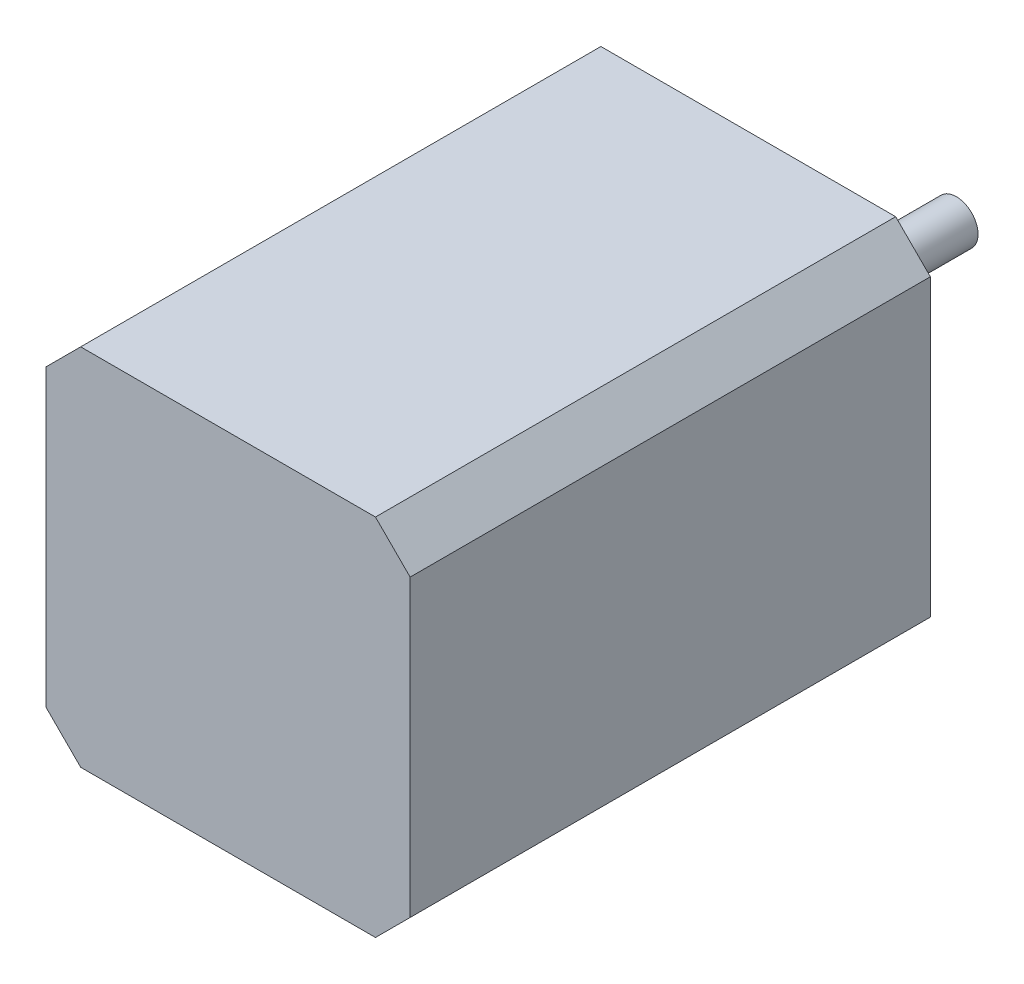
ISO-10303-21;
HEADER;
FILE_DESCRIPTION(('STEP AP214'),'2;1');
FILE_NAME('part.step','',(''),(''),'','','');
FILE_SCHEMA(('AUTOMOTIVE_DESIGN { 1 0 10303 214 1 1 1 1 }'));
ENDSEC;
DATA;
#1=APPLICATION_CONTEXT('core data for automotive mechanical design processes');
#2=APPLICATION_PROTOCOL_DEFINITION('international standard','automotive_design',2000,#1);
#3=PRODUCT_CONTEXT('',#1,'mechanical');
#4=PRODUCT('Part','Part','',(#3));
#5=PRODUCT_RELATED_PRODUCT_CATEGORY('part','',(#4));
#6=PRODUCT_DEFINITION_FORMATION('','',#4);
#7=PRODUCT_DEFINITION_CONTEXT('part definition',#1,'design');
#8=PRODUCT_DEFINITION('design','',#6,#7);
#9=PRODUCT_DEFINITION_SHAPE('','',#8);
#10=(LENGTH_UNIT() NAMED_UNIT(*) SI_UNIT(.MILLI.,.METRE.));
#11=(NAMED_UNIT(*) PLANE_ANGLE_UNIT() SI_UNIT($,.RADIAN.));
#12=(NAMED_UNIT(*) SI_UNIT($,.STERADIAN.) SOLID_ANGLE_UNIT());
#13=UNCERTAINTY_MEASURE_WITH_UNIT(LENGTH_MEASURE(1.E-05),#10,'distance_accuracy_value','');
#14=(GEOMETRIC_REPRESENTATION_CONTEXT(3) GLOBAL_UNCERTAINTY_ASSIGNED_CONTEXT((#13)) GLOBAL_UNIT_ASSIGNED_CONTEXT((#10,
#11,#12)) REPRESENTATION_CONTEXT('',''));
#15=CARTESIAN_POINT('',(0.,0.,0.));
#16=DIRECTION('',(0.,0.,1.));
#17=DIRECTION('',(1.,0.,0.));
#18=AXIS2_PLACEMENT_3D('',#15,#16,#17);
#19=CARTESIAN_POINT('',(0.,0.,0.));
#20=DIRECTION('',(0.,0.,-1.));
#21=DIRECTION('',(-1.,0.,0.));
#22=AXIS2_PLACEMENT_3D('',#19,#20,#21);
#23=PLANE('',#22);
#24=CARTESIAN_POINT('',(-15.5,-15.5,0.));
#25=DIRECTION('',(0.,0.,-1.));
#26=DIRECTION('',(-1.,0.,0.));
#27=AXIS2_PLACEMENT_3D('',#24,#25,#26);
#28=CIRCLE('',#27,1.24999999999999);
#29=CARTESIAN_POINT('',(-16.75,-15.5,0.));
#30=VERTEX_POINT('',#29);
#31=EDGE_CURVE('E161',#30,#30,#28,.T.);
#32=ORIENTED_EDGE('',*,*,#31,.F.);
#33=EDGE_LOOP('',(#32));
#34=FACE_BOUND('',#33,.T.);
#35=CARTESIAN_POINT('',(-15.5,15.5000000000001,0.));
#36=DIRECTION('',(0.,0.,-1.));
#37=DIRECTION('',(-1.,0.,0.));
#38=AXIS2_PLACEMENT_3D('',#35,#36,#37);
#39=CIRCLE('',#38,1.24999999999999);
#40=CARTESIAN_POINT('',(-16.7499999999999,15.5000000000001,0.));
#41=VERTEX_POINT('',#40);
#42=EDGE_CURVE('E175',#41,#41,#39,.T.);
#43=ORIENTED_EDGE('',*,*,#42,.F.);
#44=EDGE_LOOP('',(#43));
#45=FACE_BOUND('',#44,.T.);
#46=CARTESIAN_POINT('',(15.5,15.5,0.));
#47=DIRECTION('',(0.,0.,-1.));
#48=DIRECTION('',(-1.,0.,0.));
#49=AXIS2_PLACEMENT_3D('',#46,#47,#48);
#50=CIRCLE('',#49,1.24999999999999);
#51=CARTESIAN_POINT('',(14.25,15.5,0.));
#52=VERTEX_POINT('',#51);
#53=EDGE_CURVE('E181',#52,#52,#50,.T.);
#54=ORIENTED_EDGE('',*,*,#53,.F.);
#55=EDGE_LOOP('',(#54));
#56=FACE_BOUND('',#55,.T.);
#57=CARTESIAN_POINT('',(15.4999999999998,-15.5000000000002,0.));
#58=DIRECTION('',(0.,0.,-1.));
#59=DIRECTION('',(-1.,0.,0.));
#60=AXIS2_PLACEMENT_3D('',#57,#58,#59);
#61=CIRCLE('',#60,1.24999999999999);
#62=CARTESIAN_POINT('',(14.2499999999999,-15.5000000000002,0.));
#63=VERTEX_POINT('',#62);
#64=EDGE_CURVE('E187',#63,#63,#61,.T.);
#65=ORIENTED_EDGE('',*,*,#64,.F.);
#66=EDGE_LOOP('',(#65));
#67=FACE_BOUND('',#66,.T.);
#68=DIRECTION('',(0.70710678118654,-0.707106781186555,0.));
#69=VECTOR('',#68,1.);
#70=CARTESIAN_POINT('',(-19.0000000000002,-18.9999999999998,0.));
#71=LINE('',#70,#69);
#72=CARTESIAN_POINT('',(-21.0000000000002,-16.9999999999998,0.));
#73=VERTEX_POINT('',#72);
#74=CARTESIAN_POINT('',(-17.0000000000002,-20.9999999999998,0.));
#75=VERTEX_POINT('',#74);
#76=EDGE_CURVE('E130',#73,#75,#71,.T.);
#77=ORIENTED_EDGE('',*,*,#76,.F.);
#78=DIRECTION('',(0.,-1.,0.));
#79=VECTOR('',#78,1.);
#80=CARTESIAN_POINT('',(-21.,-21.,0.));
#81=LINE('',#80,#79);
#82=CARTESIAN_POINT('',(-21.,17.,0.));
#83=VERTEX_POINT('',#82);
#84=EDGE_CURVE('E129',#83,#73,#81,.T.);
#85=ORIENTED_EDGE('',*,*,#84,.F.);
#86=DIRECTION('',(-0.707106781186548,-0.707106781186548,0.));
#87=VECTOR('',#86,1.);
#88=CARTESIAN_POINT('',(-19.,19.,0.));
#89=LINE('',#88,#87);
#90=CARTESIAN_POINT('',(-17.,21.,0.));
#91=VERTEX_POINT('',#90);
#92=EDGE_CURVE('E164',#91,#83,#89,.T.);
#93=ORIENTED_EDGE('',*,*,#92,.F.);
#94=DIRECTION('',(-1.,0.,0.));
#95=VECTOR('',#94,1.);
#96=CARTESIAN_POINT('',(-21.,21.,0.));
#97=LINE('',#96,#95);
#98=CARTESIAN_POINT('',(17.0000000000001,20.9999999999999,0.));
#99=VERTEX_POINT('',#98);
#100=EDGE_CURVE('E144',#99,#91,#97,.T.);
#101=ORIENTED_EDGE('',*,*,#100,.F.);
#102=DIRECTION('',(-0.707106781186545,0.70710678118655,0.));
#103=VECTOR('',#102,1.);
#104=CARTESIAN_POINT('',(19.0000000000001,18.9999999999999,0.));
#105=LINE('',#104,#103);
#106=CARTESIAN_POINT('',(21.0000000000001,16.9999999999999,0.));
#107=VERTEX_POINT('',#106);
#108=EDGE_CURVE('E190',#107,#99,#105,.T.);
#109=ORIENTED_EDGE('',*,*,#108,.F.);
#110=DIRECTION('',(0.,1.,0.));
#111=VECTOR('',#110,1.);
#112=CARTESIAN_POINT('',(21.,-21.,0.));
#113=LINE('',#112,#111);
#114=CARTESIAN_POINT('',(21.,-17.,0.));
#115=VERTEX_POINT('',#114);
#116=EDGE_CURVE('E142',#115,#107,#113,.T.);
#117=ORIENTED_EDGE('',*,*,#116,.F.);
#118=DIRECTION('',(0.707106781186548,0.707106781186548,0.));
#119=VECTOR('',#118,1.);
#120=CARTESIAN_POINT('',(19.,-19.,0.));
#121=LINE('',#120,#119);
#122=CARTESIAN_POINT('',(17.,-21.,0.));
#123=VERTEX_POINT('',#122);
#124=EDGE_CURVE('E199',#123,#115,#121,.T.);
#125=ORIENTED_EDGE('',*,*,#124,.F.);
#126=DIRECTION('',(1.,0.,0.));
#127=VECTOR('',#126,1.);
#128=CARTESIAN_POINT('',(-21.,-21.,0.));
#129=LINE('',#128,#127);
#130=EDGE_CURVE('E147',#75,#123,#129,.T.);
#131=ORIENTED_EDGE('',*,*,#130,.F.);
#132=EDGE_LOOP('',(#77,#85,#93,#101,#109,#117,#125,#131));
#133=FACE_BOUND('',#132,.T.);
#134=CARTESIAN_POINT('',(0.,0.,0.));
#135=DIRECTION('',(0.,0.,-1.));
#136=DIRECTION('',(-1.,0.,0.));
#137=AXIS2_PLACEMENT_3D('',#134,#135,#136);
#138=CIRCLE('',#137,11.);
#139=CARTESIAN_POINT('',(-11.,0.,0.));
#140=VERTEX_POINT('',#139);
#141=EDGE_CURVE('E208',#140,#140,#138,.T.);
#142=ORIENTED_EDGE('',*,*,#141,.F.);
#143=EDGE_LOOP('',(#142));
#144=FACE_BOUND('',#143,.T.);
#145=ADVANCED_FACE('F38',(#34,#45,#56,#67,#133,#144),#23,.T.);
#146=CARTESIAN_POINT('',(21.,-21.,60.));
#147=DIRECTION('',(-1.,0.,0.));
#148=DIRECTION('',(0.,0.,1.));
#149=AXIS2_PLACEMENT_3D('',#146,#147,#148);
#150=PLANE('',#149);
#151=DIRECTION('',(0.,1.,0.));
#152=VECTOR('',#151,1.);
#153=CARTESIAN_POINT('',(21.,-21.,60.));
#154=LINE('',#153,#152);
#155=CARTESIAN_POINT('',(21.,-17.,60.));
#156=VERTEX_POINT('',#155);
#157=CARTESIAN_POINT('',(21.0000000000001,16.9999999999999,60.));
#158=VERTEX_POINT('',#157);
#159=EDGE_CURVE('E138',#156,#158,#154,.T.);
#160=ORIENTED_EDGE('',*,*,#159,.F.);
#161=DIRECTION('',(0.,0.,1.));
#162=VECTOR('',#161,1.);
#163=CARTESIAN_POINT('',(21.,-17.,-24.));
#164=LINE('',#163,#162);
#165=EDGE_CURVE('E63',#115,#156,#164,.T.);
#166=ORIENTED_EDGE('',*,*,#165,.F.);
#167=ORIENTED_EDGE('',*,*,#116,.T.);
#168=DIRECTION('',(0.,0.,1.));
#169=VECTOR('',#168,1.);
#170=CARTESIAN_POINT('',(21.0000000000001,16.9999999999999,-24.));
#171=LINE('',#170,#169);
#172=EDGE_CURVE('E192',#107,#158,#171,.T.);
#173=ORIENTED_EDGE('',*,*,#172,.T.);
#174=EDGE_LOOP('',(#160,#166,#167,#173));
#175=FACE_BOUND('',#174,.T.);
#176=ADVANCED_FACE('F40',(#175),#150,.F.);
#177=CARTESIAN_POINT('',(-21.,21.,60.));
#178=DIRECTION('',(0.,-1.,0.));
#179=DIRECTION('',(0.,0.,-1.));
#180=AXIS2_PLACEMENT_3D('',#177,#178,#179);
#181=PLANE('',#180);
#182=DIRECTION('',(-1.,0.,0.));
#183=VECTOR('',#182,1.);
#184=CARTESIAN_POINT('',(-21.,21.,60.));
#185=LINE('',#184,#183);
#186=CARTESIAN_POINT('',(17.,21.,60.));
#187=VERTEX_POINT('',#186);
#188=CARTESIAN_POINT('',(-17.,21.,60.));
#189=VERTEX_POINT('',#188);
#190=EDGE_CURVE('E136',#187,#189,#185,.T.);
#191=ORIENTED_EDGE('',*,*,#190,.F.);
#192=DIRECTION('',(0.,0.,1.));
#193=VECTOR('',#192,1.);
#194=CARTESIAN_POINT('',(17.0000000000001,20.9999999999999,-24.));
#195=LINE('',#194,#193);
#196=EDGE_CURVE('E193',#99,#187,#195,.T.);
#197=ORIENTED_EDGE('',*,*,#196,.F.);
#198=ORIENTED_EDGE('',*,*,#100,.T.);
#199=DIRECTION('',(0.,0.,1.));
#200=VECTOR('',#199,1.);
#201=CARTESIAN_POINT('',(-17.,21.,-24.));
#202=LINE('',#201,#200);
#203=EDGE_CURVE('E166',#91,#189,#202,.T.);
#204=ORIENTED_EDGE('',*,*,#203,.T.);
#205=EDGE_LOOP('',(#191,#197,#198,#204));
#206=FACE_BOUND('',#205,.T.);
#207=ADVANCED_FACE('F240',(#206),#181,.F.);
#208=CARTESIAN_POINT('',(-21.,-21.,60.));
#209=DIRECTION('',(1.,0.,0.));
#210=DIRECTION('',(0.,0.,-1.));
#211=AXIS2_PLACEMENT_3D('',#208,#209,#210);
#212=PLANE('',#211);
#213=ORIENTED_EDGE('',*,*,#84,.T.);
#214=DIRECTION('',(0.,0.,1.));
#215=VECTOR('',#214,1.);
#216=CARTESIAN_POINT('',(-21.0000000000002,-16.9999999999998,-24.));
#217=LINE('',#216,#215);
#218=CARTESIAN_POINT('',(-21.0000000000002,-16.9999999999998,60.));
#219=VERTEX_POINT('',#218);
#220=EDGE_CURVE('E117',#73,#219,#217,.T.);
#221=ORIENTED_EDGE('',*,*,#220,.T.);
#222=DIRECTION('',(0.,-1.,0.));
#223=VECTOR('',#222,1.);
#224=CARTESIAN_POINT('',(-21.,-21.,60.));
#225=LINE('',#224,#223);
#226=CARTESIAN_POINT('',(-21.,17.,60.));
#227=VERTEX_POINT('',#226);
#228=EDGE_CURVE('E47',#227,#219,#225,.T.);
#229=ORIENTED_EDGE('',*,*,#228,.F.);
#230=DIRECTION('',(0.,0.,1.));
#231=VECTOR('',#230,1.);
#232=CARTESIAN_POINT('',(-21.,17.,-24.));
#233=LINE('',#232,#231);
#234=EDGE_CURVE('E167',#83,#227,#233,.T.);
#235=ORIENTED_EDGE('',*,*,#234,.F.);
#236=EDGE_LOOP('',(#213,#221,#229,#235));
#237=FACE_BOUND('',#236,.T.);
#238=ADVANCED_FACE('F126',(#237),#212,.F.);
#239=CARTESIAN_POINT('',(-21.,-21.,60.));
#240=DIRECTION('',(0.,1.,0.));
#241=DIRECTION('',(0.,0.,1.));
#242=AXIS2_PLACEMENT_3D('',#239,#240,#241);
#243=PLANE('',#242);
#244=DIRECTION('',(1.,0.,0.));
#245=VECTOR('',#244,1.);
#246=CARTESIAN_POINT('',(-21.,-21.,60.));
#247=LINE('',#246,#245);
#248=CARTESIAN_POINT('',(-17.,-21.,60.));
#249=VERTEX_POINT('',#248);
#250=CARTESIAN_POINT('',(17.,-21.,60.));
#251=VERTEX_POINT('',#250);
#252=EDGE_CURVE('E11',#249,#251,#247,.T.);
#253=ORIENTED_EDGE('',*,*,#252,.F.);
#254=DIRECTION('',(0.,0.,1.));
#255=VECTOR('',#254,1.);
#256=CARTESIAN_POINT('',(-17.0000000000002,-20.9999999999998,-24.));
#257=LINE('',#256,#255);
#258=EDGE_CURVE('E55',#75,#249,#257,.T.);
#259=ORIENTED_EDGE('',*,*,#258,.F.);
#260=ORIENTED_EDGE('',*,*,#130,.T.);
#261=DIRECTION('',(0.,0.,1.));
#262=VECTOR('',#261,1.);
#263=CARTESIAN_POINT('',(17.,-21.,-24.));
#264=LINE('',#263,#262);
#265=EDGE_CURVE('E201',#123,#251,#264,.T.);
#266=ORIENTED_EDGE('',*,*,#265,.T.);
#267=EDGE_LOOP('',(#253,#259,#260,#266));
#268=FACE_BOUND('',#267,.T.);
#269=ADVANCED_FACE('F247',(#268),#243,.F.);
#270=CARTESIAN_POINT('',(0.,0.,60.));
#271=DIRECTION('',(0.,0.,-1.));
#272=DIRECTION('',(-1.,0.,0.));
#273=AXIS2_PLACEMENT_3D('',#270,#271,#272);
#274=PLANE('',#273);
#275=ORIENTED_EDGE('',*,*,#228,.T.);
#276=DIRECTION('',(-0.70710678118654,0.707106781186555,0.));
#277=VECTOR('',#276,1.);
#278=CARTESIAN_POINT('',(-17.0000000000002,-20.9999999999998,60.));
#279=LINE('',#278,#277);
#280=EDGE_CURVE('E114',#249,#219,#279,.T.);
#281=ORIENTED_EDGE('',*,*,#280,.F.);
#282=ORIENTED_EDGE('',*,*,#252,.T.);
#283=DIRECTION('',(-0.707106781186548,-0.707106781186548,0.));
#284=VECTOR('',#283,1.);
#285=CARTESIAN_POINT('',(21.,-17.,60.));
#286=LINE('',#285,#284);
#287=EDGE_CURVE('E203',#156,#251,#286,.T.);
#288=ORIENTED_EDGE('',*,*,#287,.F.);
#289=ORIENTED_EDGE('',*,*,#159,.T.);
#290=DIRECTION('',(0.707106781186545,-0.70710678118655,0.));
#291=VECTOR('',#290,1.);
#292=CARTESIAN_POINT('',(17.0000000000001,20.9999999999999,60.));
#293=LINE('',#292,#291);
#294=EDGE_CURVE('E195',#187,#158,#293,.T.);
#295=ORIENTED_EDGE('',*,*,#294,.F.);
#296=ORIENTED_EDGE('',*,*,#190,.T.);
#297=DIRECTION('',(0.707106781186548,0.707106781186548,0.));
#298=VECTOR('',#297,1.);
#299=CARTESIAN_POINT('',(-21.,17.,60.));
#300=LINE('',#299,#298);
#301=EDGE_CURVE('E135',#227,#189,#300,.T.);
#302=ORIENTED_EDGE('',*,*,#301,.F.);
#303=EDGE_LOOP('',(#275,#281,#282,#288,#289,#295,#296,#302));
#304=FACE_BOUND('',#303,.T.);
#305=ADVANCED_FACE('F133',(#304),#274,.F.);
#306=CARTESIAN_POINT('',(-15.5,-15.5,7.49999999999999));
#307=DIRECTION('',(0.,0.,-1.));
#308=DIRECTION('',(-1.,0.,0.));
#309=AXIS2_PLACEMENT_3D('',#306,#307,#308);
#310=CONICAL_SURFACE('',#309,1.24999999999999,1.02974425867664);
#311=CARTESIAN_POINT('',(-15.5,-15.5,8.25107577378445));
#312=VERTEX_POINT('',#311);
#313=VERTEX_LOOP('',#312);
#314=FACE_BOUND('',#313,.T.);
#315=CARTESIAN_POINT('',(-15.5,-15.5,7.49999999999999));
#316=DIRECTION('',(0.,0.,-1.));
#317=DIRECTION('',(-1.,0.,0.));
#318=AXIS2_PLACEMENT_3D('',#315,#316,#317);
#319=CIRCLE('',#318,1.24999999999999);
#320=CARTESIAN_POINT('',(-16.75,-15.5,7.49999999999999));
#321=VERTEX_POINT('',#320);
#322=EDGE_CURVE('E158',#321,#321,#319,.T.);
#323=ORIENTED_EDGE('',*,*,#322,.T.);
#324=EDGE_LOOP('',(#323));
#325=FACE_BOUND('',#324,.T.);
#326=ADVANCED_FACE('F306',(#314,#325),#310,.F.);
#327=CARTESIAN_POINT('',(-15.5,-15.5,0.));
#328=DIRECTION('',(0.,0.,-1.));
#329=DIRECTION('',(-1.,0.,0.));
#330=AXIS2_PLACEMENT_3D('',#327,#328,#329);
#331=CYLINDRICAL_SURFACE('',#330,1.24999999999999);
#332=ORIENTED_EDGE('',*,*,#322,.F.);
#333=EDGE_LOOP('',(#332));
#334=FACE_BOUND('',#333,.T.);
#335=ORIENTED_EDGE('',*,*,#31,.T.);
#336=EDGE_LOOP('',(#335));
#337=FACE_BOUND('',#336,.T.);
#338=ADVANCED_FACE('F303',(#334,#337),#331,.F.);
#339=CARTESIAN_POINT('',(-21.,17.,-24.));
#340=DIRECTION('',(0.707106781186547,-0.707106781186547,0.));
#341=DIRECTION('',(0.707106781186548,0.707106781186548,0.));
#342=AXIS2_PLACEMENT_3D('',#339,#340,#341);
#343=PLANE('',#342);
#344=ORIENTED_EDGE('',*,*,#92,.T.);
#345=ORIENTED_EDGE('',*,*,#234,.T.);
#346=ORIENTED_EDGE('',*,*,#301,.T.);
#347=ORIENTED_EDGE('',*,*,#203,.F.);
#348=EDGE_LOOP('',(#344,#345,#346,#347));
#349=FACE_BOUND('',#348,.T.);
#350=ADVANCED_FACE('F260',(#349),#343,.F.);
#351=CARTESIAN_POINT('',(-15.5,15.5000000000001,7.49999999999999));
#352=DIRECTION('',(0.,0.,-1.));
#353=DIRECTION('',(-1.,0.,0.));
#354=AXIS2_PLACEMENT_3D('',#351,#352,#353);
#355=CONICAL_SURFACE('',#354,1.24999999999999,1.02974425867664);
#356=CARTESIAN_POINT('',(-15.5,15.5000000000001,8.25107577378445));
#357=VERTEX_POINT('',#356);
#358=VERTEX_LOOP('',#357);
#359=FACE_BOUND('',#358,.T.);
#360=CARTESIAN_POINT('',(-15.5,15.5000000000001,7.49999999999999));
#361=DIRECTION('',(0.,0.,-1.));
#362=DIRECTION('',(-1.,0.,0.));
#363=AXIS2_PLACEMENT_3D('',#360,#361,#362);
#364=CIRCLE('',#363,1.24999999999999);
#365=CARTESIAN_POINT('',(-16.7499999999999,15.5000000000001,7.49999999999999));
#366=VERTEX_POINT('',#365);
#367=EDGE_CURVE('E172',#366,#366,#364,.T.);
#368=ORIENTED_EDGE('',*,*,#367,.T.);
#369=EDGE_LOOP('',(#368));
#370=FACE_BOUND('',#369,.T.);
#371=ADVANCED_FACE('F296',(#359,#370),#355,.F.);
#372=CARTESIAN_POINT('',(-15.5,15.5000000000001,0.));
#373=DIRECTION('',(0.,0.,-1.));
#374=DIRECTION('',(-1.,0.,0.));
#375=AXIS2_PLACEMENT_3D('',#372,#373,#374);
#376=CYLINDRICAL_SURFACE('',#375,1.24999999999999);
#377=ORIENTED_EDGE('',*,*,#367,.F.);
#378=EDGE_LOOP('',(#377));
#379=FACE_BOUND('',#378,.T.);
#380=ORIENTED_EDGE('',*,*,#42,.T.);
#381=EDGE_LOOP('',(#380));
#382=FACE_BOUND('',#381,.T.);
#383=ADVANCED_FACE('F292',(#379,#382),#376,.F.);
#384=CARTESIAN_POINT('',(15.5,15.5,7.49999999999999));
#385=DIRECTION('',(0.,0.,-1.));
#386=DIRECTION('',(-1.,0.,0.));
#387=AXIS2_PLACEMENT_3D('',#384,#385,#386);
#388=CONICAL_SURFACE('',#387,1.24999999999999,1.02974425867665);
#389=CARTESIAN_POINT('',(15.5,15.5,8.25107577378445));
#390=VERTEX_POINT('',#389);
#391=VERTEX_LOOP('',#390);
#392=FACE_BOUND('',#391,.T.);
#393=CARTESIAN_POINT('',(15.5,15.5,7.49999999999999));
#394=DIRECTION('',(0.,0.,-1.));
#395=DIRECTION('',(-1.,0.,0.));
#396=AXIS2_PLACEMENT_3D('',#393,#394,#395);
#397=CIRCLE('',#396,1.24999999999999);
#398=CARTESIAN_POINT('',(14.25,15.5,7.49999999999999));
#399=VERTEX_POINT('',#398);
#400=EDGE_CURVE('E178',#399,#399,#397,.T.);
#401=ORIENTED_EDGE('',*,*,#400,.T.);
#402=EDGE_LOOP('',(#401));
#403=FACE_BOUND('',#402,.T.);
#404=ADVANCED_FACE('F288',(#392,#403),#388,.F.);
#405=CARTESIAN_POINT('',(15.5,15.5,0.));
#406=DIRECTION('',(0.,0.,-1.));
#407=DIRECTION('',(-1.,0.,0.));
#408=AXIS2_PLACEMENT_3D('',#405,#406,#407);
#409=CYLINDRICAL_SURFACE('',#408,1.24999999999999);
#410=ORIENTED_EDGE('',*,*,#400,.F.);
#411=EDGE_LOOP('',(#410));
#412=FACE_BOUND('',#411,.T.);
#413=ORIENTED_EDGE('',*,*,#53,.T.);
#414=EDGE_LOOP('',(#413));
#415=FACE_BOUND('',#414,.T.);
#416=ADVANCED_FACE('F284',(#412,#415),#409,.F.);
#417=CARTESIAN_POINT('',(15.4999999999998,-15.5000000000002,7.49999999999999));
#418=DIRECTION('',(0.,0.,-1.));
#419=DIRECTION('',(-1.,0.,0.));
#420=AXIS2_PLACEMENT_3D('',#417,#418,#419);
#421=CONICAL_SURFACE('',#420,1.24999999999999,1.02974425867664);
#422=CARTESIAN_POINT('',(15.4999999999998,-15.5000000000002,8.25107577378445));
#423=VERTEX_POINT('',#422);
#424=VERTEX_LOOP('',#423);
#425=FACE_BOUND('',#424,.T.);
#426=CARTESIAN_POINT('',(15.4999999999998,-15.5000000000002,7.49999999999999));
#427=DIRECTION('',(0.,0.,-1.));
#428=DIRECTION('',(-1.,0.,0.));
#429=AXIS2_PLACEMENT_3D('',#426,#427,#428);
#430=CIRCLE('',#429,1.24999999999999);
#431=CARTESIAN_POINT('',(14.2499999999999,-15.5000000000002,7.49999999999999));
#432=VERTEX_POINT('',#431);
#433=EDGE_CURVE('E184',#432,#432,#430,.T.);
#434=ORIENTED_EDGE('',*,*,#433,.T.);
#435=EDGE_LOOP('',(#434));
#436=FACE_BOUND('',#435,.T.);
#437=ADVANCED_FACE('F278',(#425,#436),#421,.F.);
#438=CARTESIAN_POINT('',(15.4999999999998,-15.5000000000002,0.));
#439=DIRECTION('',(0.,0.,-1.));
#440=DIRECTION('',(-1.,0.,0.));
#441=AXIS2_PLACEMENT_3D('',#438,#439,#440);
#442=CYLINDRICAL_SURFACE('',#441,1.24999999999999);
#443=ORIENTED_EDGE('',*,*,#433,.F.);
#444=EDGE_LOOP('',(#443));
#445=FACE_BOUND('',#444,.T.);
#446=ORIENTED_EDGE('',*,*,#64,.T.);
#447=EDGE_LOOP('',(#446));
#448=FACE_BOUND('',#447,.T.);
#449=ADVANCED_FACE('F271',(#445,#448),#442,.F.);
#450=CARTESIAN_POINT('',(17.0000000000001,20.9999999999999,-24.));
#451=DIRECTION('',(-0.70710678118655,-0.707106781186545,0.));
#452=DIRECTION('',(0.707106781186545,-0.70710678118655,0.));
#453=AXIS2_PLACEMENT_3D('',#450,#451,#452);
#454=PLANE('',#453);
#455=ORIENTED_EDGE('',*,*,#108,.T.);
#456=ORIENTED_EDGE('',*,*,#196,.T.);
#457=ORIENTED_EDGE('',*,*,#294,.T.);
#458=ORIENTED_EDGE('',*,*,#172,.F.);
#459=EDGE_LOOP('',(#455,#456,#457,#458));
#460=FACE_BOUND('',#459,.T.);
#461=ADVANCED_FACE('F269',(#460),#454,.F.);
#462=CARTESIAN_POINT('',(21.,-17.,-24.));
#463=DIRECTION('',(-0.707106781186547,0.707106781186547,0.));
#464=DIRECTION('',(-0.707106781186548,-0.707106781186548,0.));
#465=AXIS2_PLACEMENT_3D('',#462,#463,#464);
#466=PLANE('',#465);
#467=ORIENTED_EDGE('',*,*,#124,.T.);
#468=ORIENTED_EDGE('',*,*,#165,.T.);
#469=ORIENTED_EDGE('',*,*,#287,.T.);
#470=ORIENTED_EDGE('',*,*,#265,.F.);
#471=EDGE_LOOP('',(#467,#468,#469,#470));
#472=FACE_BOUND('',#471,.T.);
#473=ADVANCED_FACE('F232',(#472),#466,.F.);
#474=CARTESIAN_POINT('',(-17.0000000000002,-20.9999999999998,-24.));
#475=DIRECTION('',(0.707106781186555,0.70710678118654,0.));
#476=DIRECTION('',(-0.70710678118654,0.707106781186555,0.));
#477=AXIS2_PLACEMENT_3D('',#474,#475,#476);
#478=PLANE('',#477);
#479=ORIENTED_EDGE('',*,*,#76,.T.);
#480=ORIENTED_EDGE('',*,*,#258,.T.);
#481=ORIENTED_EDGE('',*,*,#280,.T.);
#482=ORIENTED_EDGE('',*,*,#220,.F.);
#483=EDGE_LOOP('',(#479,#480,#481,#482));
#484=FACE_BOUND('',#483,.T.);
#485=ADVANCED_FACE('F116',(#484),#478,.F.);
#486=CARTESIAN_POINT('',(0.,0.,-2.));
#487=DIRECTION('',(0.,0.,-1.));
#488=DIRECTION('',(-1.,0.,0.));
#489=AXIS2_PLACEMENT_3D('',#486,#487,#488);
#490=PLANE('',#489);
#491=CARTESIAN_POINT('',(0.,0.,-2.));
#492=DIRECTION('',(0.,0.,-1.));
#493=DIRECTION('',(-1.,0.,0.));
#494=AXIS2_PLACEMENT_3D('',#491,#492,#493);
#495=CIRCLE('',#494,11.);
#496=CARTESIAN_POINT('',(-11.,0.,-2.));
#497=VERTEX_POINT('',#496);
#498=EDGE_CURVE('E211',#497,#497,#495,.T.);
#499=ORIENTED_EDGE('',*,*,#498,.T.);
#500=EDGE_LOOP('',(#499));
#501=FACE_BOUND('',#500,.T.);
#502=CARTESIAN_POINT('',(0.,0.,-2.));
#503=DIRECTION('',(0.,0.,-1.));
#504=DIRECTION('',(-1.,0.,0.));
#505=AXIS2_PLACEMENT_3D('',#502,#503,#504);
#506=CIRCLE('',#505,2.5);
#507=CARTESIAN_POINT('',(-2.5,0.,-2.));
#508=VERTEX_POINT('',#507);
#509=EDGE_CURVE('E42',#508,#508,#506,.T.);
#510=ORIENTED_EDGE('',*,*,#509,.F.);
#511=EDGE_LOOP('',(#510));
#512=FACE_BOUND('',#511,.T.);
#513=ADVANCED_FACE('F221',(#501,#512),#490,.T.);
#514=CARTESIAN_POINT('',(0.,0.,-2.));
#515=DIRECTION('',(0.,0.,1.));
#516=DIRECTION('',(1.,0.,0.));
#517=AXIS2_PLACEMENT_3D('',#514,#515,#516);
#518=CYLINDRICAL_SURFACE('',#517,11.);
#519=ORIENTED_EDGE('',*,*,#498,.F.);
#520=EDGE_LOOP('',(#519));
#521=FACE_BOUND('',#520,.T.);
#522=ORIENTED_EDGE('',*,*,#141,.T.);
#523=EDGE_LOOP('',(#522));
#524=FACE_BOUND('',#523,.T.);
#525=ADVANCED_FACE('F223',(#521,#524),#518,.T.);
#526=CARTESIAN_POINT('',(0.,0.,-24.));
#527=DIRECTION('',(0.,0.,-1.));
#528=DIRECTION('',(-1.,0.,0.));
#529=AXIS2_PLACEMENT_3D('',#526,#527,#528);
#530=PLANE('',#529);
#531=CARTESIAN_POINT('',(0.,0.,-24.));
#532=DIRECTION('',(0.,0.,-1.));
#533=DIRECTION('',(-1.,0.,0.));
#534=AXIS2_PLACEMENT_3D('',#531,#532,#533);
#535=CIRCLE('',#534,2.5);
#536=CARTESIAN_POINT('',(-2.5,0.,-24.));
#537=VERTEX_POINT('',#536);
#538=EDGE_CURVE('E145',#537,#537,#535,.T.);
#539=ORIENTED_EDGE('',*,*,#538,.T.);
#540=EDGE_LOOP('',(#539));
#541=FACE_BOUND('',#540,.T.);
#542=ADVANCED_FACE('F229',(#541),#530,.T.);
#543=CARTESIAN_POINT('',(0.,0.,-24.));
#544=DIRECTION('',(0.,0.,1.));
#545=DIRECTION('',(1.,0.,0.));
#546=AXIS2_PLACEMENT_3D('',#543,#544,#545);
#547=CYLINDRICAL_SURFACE('',#546,2.5);
#548=ORIENTED_EDGE('',*,*,#509,.T.);
#549=EDGE_LOOP('',(#548));
#550=FACE_BOUND('',#549,.T.);
#551=ORIENTED_EDGE('',*,*,#538,.F.);
#552=EDGE_LOOP('',(#551));
#553=FACE_BOUND('',#552,.T.);
#554=ADVANCED_FACE('F218',(#550,#553),#547,.T.);
#555=CLOSED_SHELL('',(#145,#176,#207,#238,#269,#305,#326,#338,#350,#371,#383,#404,#416,#437,
#449,#461,#473,#485,#513,#525,#542,#554));
#556=MANIFOLD_SOLID_BREP('B2',#555);
#557=ADVANCED_BREP_SHAPE_REPRESENTATION('',(#18,#556),#14);
#558=SHAPE_DEFINITION_REPRESENTATION(#9,#557);
ENDSEC;
END-ISO-10303-21;
